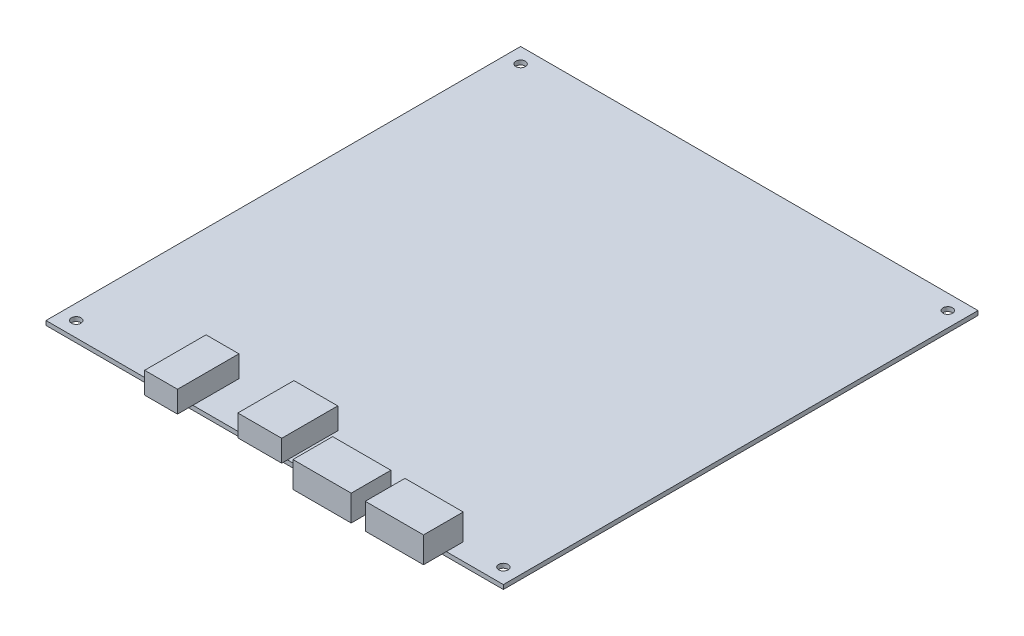
ISO-10303-21;
HEADER;
FILE_DESCRIPTION(('STEP AP214'),'2;1');
FILE_NAME('part.step','',(''),(''),'','','');
FILE_SCHEMA(('AUTOMOTIVE_DESIGN { 1 0 10303 214 1 1 1 1 }'));
ENDSEC;
DATA;
#1=APPLICATION_CONTEXT('core data for automotive mechanical design processes');
#2=APPLICATION_PROTOCOL_DEFINITION('international standard','automotive_design',2000,#1);
#3=PRODUCT_CONTEXT('',#1,'mechanical');
#4=PRODUCT('Part','Part','',(#3));
#5=PRODUCT_RELATED_PRODUCT_CATEGORY('part','',(#4));
#6=PRODUCT_DEFINITION_FORMATION('','',#4);
#7=PRODUCT_DEFINITION_CONTEXT('part definition',#1,'design');
#8=PRODUCT_DEFINITION('design','',#6,#7);
#9=PRODUCT_DEFINITION_SHAPE('','',#8);
#10=(LENGTH_UNIT() NAMED_UNIT(*) SI_UNIT(.MILLI.,.METRE.));
#11=(NAMED_UNIT(*) PLANE_ANGLE_UNIT() SI_UNIT($,.RADIAN.));
#12=(NAMED_UNIT(*) SI_UNIT($,.STERADIAN.) SOLID_ANGLE_UNIT());
#13=UNCERTAINTY_MEASURE_WITH_UNIT(LENGTH_MEASURE(1.E-05),#10,'distance_accuracy_value','');
#14=(GEOMETRIC_REPRESENTATION_CONTEXT(3) GLOBAL_UNCERTAINTY_ASSIGNED_CONTEXT((#13)) GLOBAL_UNIT_ASSIGNED_CONTEXT((#10,
#11,#12)) REPRESENTATION_CONTEXT('',''));
#15=CARTESIAN_POINT('',(0.,0.,0.));
#16=DIRECTION('',(0.,0.,1.));
#17=DIRECTION('',(1.,0.,0.));
#18=AXIS2_PLACEMENT_3D('',#15,#16,#17);
#19=CARTESIAN_POINT('',(-44.0442723681258,1.,10.0561799951606));
#20=DIRECTION('',(0.,1.,0.));
#21=DIRECTION('',(0.,0.,1.));
#22=AXIS2_PLACEMENT_3D('',#19,#20,#21);
#23=PLANE('',#22);
#24=CARTESIAN_POINT('',(58.4557276318742,1.,-96.4438200048394));
#25=DIRECTION('',(0.,1.,0.));
#26=DIRECTION('',(0.,0.,1.));
#27=AXIS2_PLACEMENT_3D('',#24,#25,#26);
#28=CIRCLE('',#27,1.10000000000001);
#29=CARTESIAN_POINT('',(58.4557276318742,1.,-95.3438200048394));
#30=VERTEX_POINT('',#29);
#31=EDGE_CURVE('E324',#30,#30,#28,.T.);
#32=ORIENTED_EDGE('',*,*,#31,.F.);
#33=EDGE_LOOP('',(#32));
#34=FACE_BOUND('',#33,.T.);
#35=CARTESIAN_POINT('',(58.4557276318742,1.,6.55617999516062));
#36=DIRECTION('',(0.,1.,0.));
#37=DIRECTION('',(0.,0.,1.));
#38=AXIS2_PLACEMENT_3D('',#35,#36,#37);
#39=CIRCLE('',#38,1.10000000000001);
#40=CARTESIAN_POINT('',(58.4557276318742,1.,7.65617999516062));
#41=VERTEX_POINT('',#40);
#42=EDGE_CURVE('E336',#41,#41,#39,.T.);
#43=ORIENTED_EDGE('',*,*,#42,.F.);
#44=EDGE_LOOP('',(#43));
#45=FACE_BOUND('',#44,.T.);
#46=CARTESIAN_POINT('',(-40.5442723681258,1.,6.55617999516062));
#47=DIRECTION('',(0.,1.,0.));
#48=DIRECTION('',(0.,0.,1.));
#49=AXIS2_PLACEMENT_3D('',#46,#47,#48);
#50=CIRCLE('',#49,1.10000000000001);
#51=CARTESIAN_POINT('',(-40.5442723681258,1.,7.65617999516063));
#52=VERTEX_POINT('',#51);
#53=EDGE_CURVE('E342',#52,#52,#50,.T.);
#54=ORIENTED_EDGE('',*,*,#53,.F.);
#55=EDGE_LOOP('',(#54));
#56=FACE_BOUND('',#55,.T.);
#57=CARTESIAN_POINT('',(-40.5442723681258,1.,-96.4438200048394));
#58=DIRECTION('',(0.,1.,0.));
#59=DIRECTION('',(0.,0.,1.));
#60=AXIS2_PLACEMENT_3D('',#57,#58,#59);
#61=CIRCLE('',#60,1.10000000000001);
#62=CARTESIAN_POINT('',(-40.5442723681258,1.,-95.3438200048394));
#63=VERTEX_POINT('',#62);
#64=EDGE_CURVE('E330',#63,#63,#61,.T.);
#65=ORIENTED_EDGE('',*,*,#64,.F.);
#66=EDGE_LOOP('',(#65));
#67=FACE_BOUND('',#66,.T.);
#68=DIRECTION('',(1.,0.,0.));
#69=VECTOR('',#68,1.);
#70=CARTESIAN_POINT('',(-44.0442723681258,1.,10.0561799951606));
#71=LINE('',#70,#69);
#72=CARTESIAN_POINT('',(31.9757276318742,1.,10.0561799951606));
#73=VERTEX_POINT('',#72);
#74=CARTESIAN_POINT('',(35.2357276318742,1.,10.0561799951606));
#75=VERTEX_POINT('',#74);
#76=EDGE_CURVE('E400',#73,#75,#71,.T.);
#77=ORIENTED_EDGE('',*,*,#76,.T.);
#78=DIRECTION('',(0.,0.,1.));
#79=VECTOR('',#78,1.);
#80=CARTESIAN_POINT('',(35.2357276318742,1.,6.14617999516061));
#81=LINE('',#80,#79);
#82=CARTESIAN_POINT('',(35.2357276318742,1.,6.14617999516061));
#83=VERTEX_POINT('',#82);
#84=EDGE_CURVE('E57',#83,#75,#81,.T.);
#85=ORIENTED_EDGE('',*,*,#84,.F.);
#86=DIRECTION('',(-1.,0.,0.));
#87=VECTOR('',#86,1.);
#88=CARTESIAN_POINT('',(35.2357276318742,1.,6.14617999516061));
#89=LINE('',#88,#87);
#90=CARTESIAN_POINT('',(48.7357276318742,1.,6.14617999516061));
#91=VERTEX_POINT('',#90);
#92=EDGE_CURVE('E52',#91,#83,#89,.T.);
#93=ORIENTED_EDGE('',*,*,#92,.F.);
#94=DIRECTION('',(0.,0.,-1.));
#95=VECTOR('',#94,1.);
#96=CARTESIAN_POINT('',(48.7357276318742,1.,6.14617999516061));
#97=LINE('',#96,#95);
#98=CARTESIAN_POINT('',(48.7357276318742,1.,10.0561799951606));
#99=VERTEX_POINT('',#98);
#100=EDGE_CURVE('E397',#99,#91,#97,.T.);
#101=ORIENTED_EDGE('',*,*,#100,.F.);
#102=CARTESIAN_POINT('',(61.9557276318742,1.,10.0561799951606));
#103=VERTEX_POINT('',#102);
#104=EDGE_CURVE('E351',#99,#103,#71,.T.);
#105=ORIENTED_EDGE('',*,*,#104,.T.);
#106=DIRECTION('',(0.,0.,-1.));
#107=VECTOR('',#106,1.);
#108=CARTESIAN_POINT('',(61.9557276318742,1.,-99.9438200048394));
#109=LINE('',#108,#107);
#110=CARTESIAN_POINT('',(61.9557276318742,1.,-99.9438200048394));
#111=VERTEX_POINT('',#110);
#112=EDGE_CURVE('E355',#103,#111,#109,.T.);
#113=ORIENTED_EDGE('',*,*,#112,.T.);
#114=DIRECTION('',(-1.,0.,0.));
#115=VECTOR('',#114,1.);
#116=CARTESIAN_POINT('',(-44.0442723681258,1.,-99.9438200048394));
#117=LINE('',#116,#115);
#118=CARTESIAN_POINT('',(-44.0442723681258,1.,-99.9438200048394));
#119=VERTEX_POINT('',#118);
#120=EDGE_CURVE('E358',#111,#119,#117,.T.);
#121=ORIENTED_EDGE('',*,*,#120,.T.);
#122=DIRECTION('',(0.,0.,1.));
#123=VECTOR('',#122,1.);
#124=CARTESIAN_POINT('',(-44.0442723681258,1.,-99.9438200048394));
#125=LINE('',#124,#123);
#126=CARTESIAN_POINT('',(-44.0442723681258,1.,10.0561799951606));
#127=VERTEX_POINT('',#126);
#128=EDGE_CURVE('E348',#119,#127,#125,.T.);
#129=ORIENTED_EDGE('',*,*,#128,.T.);
#130=CARTESIAN_POINT('',(-17.6242723681258,1.,10.0561799951606));
#131=VERTEX_POINT('',#130);
#132=EDGE_CURVE('E353',#127,#131,#71,.T.);
#133=ORIENTED_EDGE('',*,*,#132,.T.);
#134=DIRECTION('',(0.,0.,1.));
#135=VECTOR('',#134,1.);
#136=CARTESIAN_POINT('',(-17.6242723681258,1.,-0.613820004839382));
#137=LINE('',#136,#135);
#138=CARTESIAN_POINT('',(-17.6242723681258,1.,-0.613820004839382));
#139=VERTEX_POINT('',#138);
#140=EDGE_CURVE('E308',#139,#131,#137,.T.);
#141=ORIENTED_EDGE('',*,*,#140,.F.);
#142=DIRECTION('',(-1.,0.,0.));
#143=VECTOR('',#142,1.);
#144=CARTESIAN_POINT('',(-17.6242723681258,1.,-0.613820004839382));
#145=LINE('',#144,#143);
#146=CARTESIAN_POINT('',(-10.0042723681258,1.,-0.613820004839382));
#147=VERTEX_POINT('',#146);
#148=EDGE_CURVE('E300',#147,#139,#145,.T.);
#149=ORIENTED_EDGE('',*,*,#148,.F.);
#150=DIRECTION('',(0.,0.,-1.));
#151=VECTOR('',#150,1.);
#152=CARTESIAN_POINT('',(-10.0042723681258,1.,-0.613820004839382));
#153=LINE('',#152,#151);
#154=CARTESIAN_POINT('',(-10.0042723681258,1.,10.0561799951606));
#155=VERTEX_POINT('',#154);
#156=EDGE_CURVE('E12',#155,#147,#153,.T.);
#157=ORIENTED_EDGE('',*,*,#156,.F.);
#158=CARTESIAN_POINT('',(1.74572763187419,1.,10.0561799951606));
#159=VERTEX_POINT('',#158);
#160=EDGE_CURVE('E415',#155,#159,#71,.T.);
#161=ORIENTED_EDGE('',*,*,#160,.T.);
#162=DIRECTION('',(0.,0.,1.));
#163=VECTOR('',#162,1.);
#164=CARTESIAN_POINT('',(1.74572763187418,1.,-1.61382000483938));
#165=LINE('',#164,#163);
#166=CARTESIAN_POINT('',(1.74572763187419,1.,-1.61382000483938));
#167=VERTEX_POINT('',#166);
#168=EDGE_CURVE('E273',#167,#159,#165,.T.);
#169=ORIENTED_EDGE('',*,*,#168,.F.);
#170=DIRECTION('',(-1.,0.,0.));
#171=VECTOR('',#170,1.);
#172=CARTESIAN_POINT('',(1.74572763187418,1.,-1.61382000483938));
#173=LINE('',#172,#171);
#174=CARTESIAN_POINT('',(11.9057276318742,1.,-1.61382000483938));
#175=VERTEX_POINT('',#174);
#176=EDGE_CURVE('E266',#175,#167,#173,.T.);
#177=ORIENTED_EDGE('',*,*,#176,.F.);
#178=DIRECTION('',(0.,0.,-1.));
#179=VECTOR('',#178,1.);
#180=CARTESIAN_POINT('',(11.9057276318742,1.,-1.61382000483938));
#181=LINE('',#180,#179);
#182=CARTESIAN_POINT('',(11.9057276318742,1.,10.0561799951606));
#183=VERTEX_POINT('',#182);
#184=EDGE_CURVE('E278',#183,#175,#181,.T.);
#185=ORIENTED_EDGE('',*,*,#184,.F.);
#186=CARTESIAN_POINT('',(18.4757276318742,1.,10.0561799951606));
#187=VERTEX_POINT('',#186);
#188=EDGE_CURVE('E407',#183,#187,#71,.T.);
#189=ORIENTED_EDGE('',*,*,#188,.T.);
#190=DIRECTION('',(0.,0.,1.));
#191=VECTOR('',#190,1.);
#192=CARTESIAN_POINT('',(18.4757276318742,1.,6.14617999516062));
#193=LINE('',#192,#191);
#194=CARTESIAN_POINT('',(18.4757276318742,1.,6.14617999516062));
#195=VERTEX_POINT('',#194);
#196=EDGE_CURVE('E224',#195,#187,#193,.T.);
#197=ORIENTED_EDGE('',*,*,#196,.F.);
#198=DIRECTION('',(-1.,0.,0.));
#199=VECTOR('',#198,1.);
#200=CARTESIAN_POINT('',(18.4757276318742,1.,6.14617999516062));
#201=LINE('',#200,#199);
#202=CARTESIAN_POINT('',(31.9757276318742,1.,6.14617999516061));
#203=VERTEX_POINT('',#202);
#204=EDGE_CURVE('E234',#203,#195,#201,.T.);
#205=ORIENTED_EDGE('',*,*,#204,.F.);
#206=DIRECTION('',(0.,0.,-1.));
#207=VECTOR('',#206,1.);
#208=CARTESIAN_POINT('',(31.9757276318742,1.,6.14617999516061));
#209=LINE('',#208,#207);
#210=EDGE_CURVE('E244',#73,#203,#209,.T.);
#211=ORIENTED_EDGE('',*,*,#210,.F.);
#212=EDGE_LOOP('',(#77,#85,#93,#101,#105,#113,#121,#129,#133,#141,#149,#157,#161,#169,#177,#185,
#189,#197,#205,#211));
#213=FACE_BOUND('',#212,.T.);
#214=ADVANCED_FACE('F36',(#34,#45,#56,#67,#213),#23,.T.);
#215=CARTESIAN_POINT('',(-44.0442723681258,0.,10.0561799951606));
#216=DIRECTION('',(0.,1.,0.));
#217=DIRECTION('',(0.,0.,1.));
#218=AXIS2_PLACEMENT_3D('',#215,#216,#217);
#219=PLANE('',#218);
#220=CARTESIAN_POINT('',(-40.5442723681258,0.,-96.4438200048394));
#221=DIRECTION('',(0.,1.,0.));
#222=DIRECTION('',(0.,0.,1.));
#223=AXIS2_PLACEMENT_3D('',#220,#221,#222);
#224=CIRCLE('',#223,1.10000000000001);
#225=CARTESIAN_POINT('',(-40.5442723681258,0.,-95.3438200048394));
#226=VERTEX_POINT('',#225);
#227=EDGE_CURVE('E327',#226,#226,#224,.T.);
#228=ORIENTED_EDGE('',*,*,#227,.T.);
#229=EDGE_LOOP('',(#228));
#230=FACE_BOUND('',#229,.T.);
#231=CARTESIAN_POINT('',(-40.5442723681258,0.,6.55617999516062));
#232=DIRECTION('',(0.,1.,0.));
#233=DIRECTION('',(0.,0.,1.));
#234=AXIS2_PLACEMENT_3D('',#231,#232,#233);
#235=CIRCLE('',#234,1.10000000000001);
#236=CARTESIAN_POINT('',(-40.5442723681258,0.,7.65617999516063));
#237=VERTEX_POINT('',#236);
#238=EDGE_CURVE('E339',#237,#237,#235,.T.);
#239=ORIENTED_EDGE('',*,*,#238,.T.);
#240=EDGE_LOOP('',(#239));
#241=FACE_BOUND('',#240,.T.);
#242=DIRECTION('',(0.,0.,1.));
#243=VECTOR('',#242,1.);
#244=CARTESIAN_POINT('',(-44.0442723681258,0.,-99.9438200048394));
#245=LINE('',#244,#243);
#246=CARTESIAN_POINT('',(-44.0442723681258,0.,-99.9438200048394));
#247=VERTEX_POINT('',#246);
#248=CARTESIAN_POINT('',(-44.0442723681258,0.,10.0561799951606));
#249=VERTEX_POINT('',#248);
#250=EDGE_CURVE('E345',#247,#249,#245,.T.);
#251=ORIENTED_EDGE('',*,*,#250,.F.);
#252=DIRECTION('',(-1.,0.,0.));
#253=VECTOR('',#252,1.);
#254=CARTESIAN_POINT('',(-44.0442723681258,0.,-99.9438200048394));
#255=LINE('',#254,#253);
#256=CARTESIAN_POINT('',(61.9557276318742,0.,-99.9438200048394));
#257=VERTEX_POINT('',#256);
#258=EDGE_CURVE('E352',#257,#247,#255,.T.);
#259=ORIENTED_EDGE('',*,*,#258,.F.);
#260=DIRECTION('',(0.,0.,-1.));
#261=VECTOR('',#260,1.);
#262=CARTESIAN_POINT('',(61.9557276318742,0.,-99.9438200048394));
#263=LINE('',#262,#261);
#264=CARTESIAN_POINT('',(61.9557276318742,0.,10.0561799951606));
#265=VERTEX_POINT('',#264);
#266=EDGE_CURVE('E365',#265,#257,#263,.T.);
#267=ORIENTED_EDGE('',*,*,#266,.F.);
#268=DIRECTION('',(1.,0.,0.));
#269=VECTOR('',#268,1.);
#270=CARTESIAN_POINT('',(-44.0442723681258,0.,10.0561799951606));
#271=LINE('',#270,#269);
#272=EDGE_CURVE('E363',#249,#265,#271,.T.);
#273=ORIENTED_EDGE('',*,*,#272,.F.);
#274=EDGE_LOOP('',(#251,#259,#267,#273));
#275=FACE_BOUND('',#274,.T.);
#276=CARTESIAN_POINT('',(58.4557276318742,0.,6.55617999516062));
#277=DIRECTION('',(0.,1.,0.));
#278=DIRECTION('',(0.,0.,1.));
#279=AXIS2_PLACEMENT_3D('',#276,#277,#278);
#280=CIRCLE('',#279,1.10000000000001);
#281=CARTESIAN_POINT('',(58.4557276318742,0.,7.65617999516062));
#282=VERTEX_POINT('',#281);
#283=EDGE_CURVE('E333',#282,#282,#280,.T.);
#284=ORIENTED_EDGE('',*,*,#283,.T.);
#285=EDGE_LOOP('',(#284));
#286=FACE_BOUND('',#285,.T.);
#287=CARTESIAN_POINT('',(58.4557276318742,0.,-96.4438200048394));
#288=DIRECTION('',(0.,1.,0.));
#289=DIRECTION('',(0.,0.,1.));
#290=AXIS2_PLACEMENT_3D('',#287,#288,#289);
#291=CIRCLE('',#290,1.10000000000001);
#292=CARTESIAN_POINT('',(58.4557276318742,0.,-95.3438200048394));
#293=VERTEX_POINT('',#292);
#294=EDGE_CURVE('E311',#293,#293,#291,.T.);
#295=ORIENTED_EDGE('',*,*,#294,.T.);
#296=EDGE_LOOP('',(#295));
#297=FACE_BOUND('',#296,.T.);
#298=ADVANCED_FACE('F387',(#230,#241,#275,#286,#297),#219,.F.);
#299=CARTESIAN_POINT('',(-44.0442723681258,1.,-99.9438200048394));
#300=DIRECTION('',(1.,0.,0.));
#301=DIRECTION('',(0.,0.,-1.));
#302=AXIS2_PLACEMENT_3D('',#299,#300,#301);
#303=PLANE('',#302);
#304=ORIENTED_EDGE('',*,*,#250,.T.);
#305=DIRECTION('',(0.,-1.,0.));
#306=VECTOR('',#305,1.);
#307=CARTESIAN_POINT('',(-44.0442723681258,1.,10.0561799951606));
#308=LINE('',#307,#306);
#309=EDGE_CURVE('E45',#127,#249,#308,.T.);
#310=ORIENTED_EDGE('',*,*,#309,.F.);
#311=ORIENTED_EDGE('',*,*,#128,.F.);
#312=DIRECTION('',(0.,-1.,0.));
#313=VECTOR('',#312,1.);
#314=CARTESIAN_POINT('',(-44.0442723681258,1.,-99.9438200048394));
#315=LINE('',#314,#313);
#316=EDGE_CURVE('E360',#119,#247,#315,.T.);
#317=ORIENTED_EDGE('',*,*,#316,.T.);
#318=EDGE_LOOP('',(#304,#310,#311,#317));
#319=FACE_BOUND('',#318,.T.);
#320=ADVANCED_FACE('F38',(#319),#303,.F.);
#321=CARTESIAN_POINT('',(-44.0442723681258,1.,10.0561799951606));
#322=DIRECTION('',(0.,0.,-1.));
#323=DIRECTION('',(-1.,0.,0.));
#324=AXIS2_PLACEMENT_3D('',#321,#322,#323);
#325=PLANE('',#324);
#326=ORIENTED_EDGE('',*,*,#272,.T.);
#327=DIRECTION('',(0.,-1.,0.));
#328=VECTOR('',#327,1.);
#329=CARTESIAN_POINT('',(61.9557276318742,1.,10.0561799951606));
#330=LINE('',#329,#328);
#331=EDGE_CURVE('E373',#103,#265,#330,.T.);
#332=ORIENTED_EDGE('',*,*,#331,.F.);
#333=ORIENTED_EDGE('',*,*,#104,.F.);
#334=EDGE_CURVE('E399',#75,#99,#71,.T.);
#335=ORIENTED_EDGE('',*,*,#334,.F.);
#336=ORIENTED_EDGE('',*,*,#76,.F.);
#337=EDGE_CURVE('E404',#187,#73,#71,.T.);
#338=ORIENTED_EDGE('',*,*,#337,.F.);
#339=ORIENTED_EDGE('',*,*,#188,.F.);
#340=EDGE_CURVE('E412',#159,#183,#71,.T.);
#341=ORIENTED_EDGE('',*,*,#340,.F.);
#342=ORIENTED_EDGE('',*,*,#160,.F.);
#343=EDGE_CURVE('E356',#131,#155,#71,.T.);
#344=ORIENTED_EDGE('',*,*,#343,.F.);
#345=ORIENTED_EDGE('',*,*,#132,.F.);
#346=ORIENTED_EDGE('',*,*,#309,.T.);
#347=EDGE_LOOP('',(#326,#332,#333,#335,#336,#338,#339,#341,#342,#344,#345,#346));
#348=FACE_BOUND('',#347,.T.);
#349=ADVANCED_FACE('F378',(#348),#325,.F.);
#350=CARTESIAN_POINT('',(61.9557276318742,1.,-99.9438200048394));
#351=DIRECTION('',(-1.,0.,0.));
#352=DIRECTION('',(0.,0.,1.));
#353=AXIS2_PLACEMENT_3D('',#350,#351,#352);
#354=PLANE('',#353);
#355=ORIENTED_EDGE('',*,*,#266,.T.);
#356=DIRECTION('',(0.,-1.,0.));
#357=VECTOR('',#356,1.);
#358=CARTESIAN_POINT('',(61.9557276318742,1.,-99.9438200048394));
#359=LINE('',#358,#357);
#360=EDGE_CURVE('E370',#111,#257,#359,.T.);
#361=ORIENTED_EDGE('',*,*,#360,.F.);
#362=ORIENTED_EDGE('',*,*,#112,.F.);
#363=ORIENTED_EDGE('',*,*,#331,.T.);
#364=EDGE_LOOP('',(#355,#361,#362,#363));
#365=FACE_BOUND('',#364,.T.);
#366=ADVANCED_FACE('F392',(#365),#354,.F.);
#367=CARTESIAN_POINT('',(-44.0442723681258,1.,-99.9438200048394));
#368=DIRECTION('',(0.,0.,1.));
#369=DIRECTION('',(1.,0.,0.));
#370=AXIS2_PLACEMENT_3D('',#367,#368,#369);
#371=PLANE('',#370);
#372=ORIENTED_EDGE('',*,*,#258,.T.);
#373=ORIENTED_EDGE('',*,*,#316,.F.);
#374=ORIENTED_EDGE('',*,*,#120,.F.);
#375=ORIENTED_EDGE('',*,*,#360,.T.);
#376=EDGE_LOOP('',(#372,#373,#374,#375));
#377=FACE_BOUND('',#376,.T.);
#378=ADVANCED_FACE('F396',(#377),#371,.F.);
#379=CARTESIAN_POINT('',(-40.5442723681258,1.,6.55617999516062));
#380=DIRECTION('',(0.,-1.,0.));
#381=DIRECTION('',(0.,0.,-1.));
#382=AXIS2_PLACEMENT_3D('',#379,#380,#381);
#383=CYLINDRICAL_SURFACE('',#382,1.10000000000001);
#384=ORIENTED_EDGE('',*,*,#53,.T.);
#385=EDGE_LOOP('',(#384));
#386=FACE_BOUND('',#385,.T.);
#387=ORIENTED_EDGE('',*,*,#238,.F.);
#388=EDGE_LOOP('',(#387));
#389=FACE_BOUND('',#388,.T.);
#390=ADVANCED_FACE('F500',(#386,#389),#383,.F.);
#391=CARTESIAN_POINT('',(58.4557276318742,1.,6.55617999516062));
#392=DIRECTION('',(0.,-1.,0.));
#393=DIRECTION('',(0.,0.,-1.));
#394=AXIS2_PLACEMENT_3D('',#391,#392,#393);
#395=CYLINDRICAL_SURFACE('',#394,1.10000000000001);
#396=ORIENTED_EDGE('',*,*,#42,.T.);
#397=EDGE_LOOP('',(#396));
#398=FACE_BOUND('',#397,.T.);
#399=ORIENTED_EDGE('',*,*,#283,.F.);
#400=EDGE_LOOP('',(#399));
#401=FACE_BOUND('',#400,.T.);
#402=ADVANCED_FACE('F543',(#398,#401),#395,.F.);
#403=CARTESIAN_POINT('',(-40.5442723681258,1.,-96.4438200048394));
#404=DIRECTION('',(0.,-1.,0.));
#405=DIRECTION('',(0.,0.,-1.));
#406=AXIS2_PLACEMENT_3D('',#403,#404,#405);
#407=CYLINDRICAL_SURFACE('',#406,1.10000000000001);
#408=ORIENTED_EDGE('',*,*,#64,.T.);
#409=EDGE_LOOP('',(#408));
#410=FACE_BOUND('',#409,.T.);
#411=ORIENTED_EDGE('',*,*,#227,.F.);
#412=EDGE_LOOP('',(#411));
#413=FACE_BOUND('',#412,.T.);
#414=ADVANCED_FACE('F551',(#410,#413),#407,.F.);
#415=CARTESIAN_POINT('',(58.4557276318742,1.,-96.4438200048394));
#416=DIRECTION('',(0.,-1.,0.));
#417=DIRECTION('',(0.,0.,-1.));
#418=AXIS2_PLACEMENT_3D('',#415,#416,#417);
#419=CYLINDRICAL_SURFACE('',#418,1.10000000000001);
#420=ORIENTED_EDGE('',*,*,#31,.T.);
#421=EDGE_LOOP('',(#420));
#422=FACE_BOUND('',#421,.T.);
#423=ORIENTED_EDGE('',*,*,#294,.F.);
#424=EDGE_LOOP('',(#423));
#425=FACE_BOUND('',#424,.T.);
#426=ADVANCED_FACE('F483',(#422,#425),#419,.F.);
#427=CARTESIAN_POINT('',(-39.5117966688814,1.,6.50117999516062));
#428=DIRECTION('',(0.,1.,0.));
#429=DIRECTION('',(0.,0.,1.));
#430=AXIS2_PLACEMENT_3D('',#427,#428,#429);
#431=PLANE('',#430);
#432=CARTESIAN_POINT('',(-17.6242723681258,1.,13.6161799951606));
#433=VERTEX_POINT('',#432);
#434=EDGE_CURVE('E312',#131,#433,#137,.T.);
#435=ORIENTED_EDGE('',*,*,#434,.F.);
#436=ORIENTED_EDGE('',*,*,#343,.T.);
#437=CARTESIAN_POINT('',(-10.0042723681258,1.,13.6161799951606));
#438=VERTEX_POINT('',#437);
#439=EDGE_CURVE('E427',#438,#155,#153,.T.);
#440=ORIENTED_EDGE('',*,*,#439,.F.);
#441=DIRECTION('',(1.,0.,0.));
#442=VECTOR('',#441,1.);
#443=CARTESIAN_POINT('',(-17.6242723681258,1.,13.6161799951606));
#444=LINE('',#443,#442);
#445=EDGE_CURVE('E458',#433,#438,#444,.T.);
#446=ORIENTED_EDGE('',*,*,#445,.F.);
#447=EDGE_LOOP('',(#435,#436,#440,#446));
#448=FACE_BOUND('',#447,.T.);
#449=ADVANCED_FACE('F425',(#448),#431,.F.);
#450=CARTESIAN_POINT('',(-39.5117966688814,6.,6.50117999516062));
#451=DIRECTION('',(0.,1.,0.));
#452=DIRECTION('',(0.,0.,1.));
#453=AXIS2_PLACEMENT_3D('',#450,#451,#452);
#454=PLANE('',#453);
#455=DIRECTION('',(-1.,0.,0.));
#456=VECTOR('',#455,1.);
#457=CARTESIAN_POINT('',(-17.6242723681258,6.,-0.613820004839382));
#458=LINE('',#457,#456);
#459=CARTESIAN_POINT('',(-10.0042723681258,6.,-0.613820004839382));
#460=VERTEX_POINT('',#459);
#461=CARTESIAN_POINT('',(-17.6242723681258,6.,-0.613820004839382));
#462=VERTEX_POINT('',#461);
#463=EDGE_CURVE('E295',#460,#462,#458,.T.);
#464=ORIENTED_EDGE('',*,*,#463,.T.);
#465=DIRECTION('',(0.,0.,1.));
#466=VECTOR('',#465,1.);
#467=CARTESIAN_POINT('',(-17.6242723681258,6.,-0.613820004839382));
#468=LINE('',#467,#466);
#469=CARTESIAN_POINT('',(-17.6242723681258,6.,13.6161799951606));
#470=VERTEX_POINT('',#469);
#471=EDGE_CURVE('E321',#462,#470,#468,.T.);
#472=ORIENTED_EDGE('',*,*,#471,.T.);
#473=DIRECTION('',(1.,0.,0.));
#474=VECTOR('',#473,1.);
#475=CARTESIAN_POINT('',(-17.6242723681258,6.,13.6161799951606));
#476=LINE('',#475,#474);
#477=CARTESIAN_POINT('',(-10.0042723681258,6.,13.6161799951606));
#478=VERTEX_POINT('',#477);
#479=EDGE_CURVE('E437',#470,#478,#476,.T.);
#480=ORIENTED_EDGE('',*,*,#479,.T.);
#481=DIRECTION('',(0.,0.,-1.));
#482=VECTOR('',#481,1.);
#483=CARTESIAN_POINT('',(-10.0042723681258,6.,-0.613820004839382));
#484=LINE('',#483,#482);
#485=EDGE_CURVE('E299',#478,#460,#484,.T.);
#486=ORIENTED_EDGE('',*,*,#485,.T.);
#487=EDGE_LOOP('',(#464,#472,#480,#486));
#488=FACE_BOUND('',#487,.T.);
#489=ADVANCED_FACE('F472',(#488),#454,.T.);
#490=CARTESIAN_POINT('',(-17.6242723681258,1.,-0.613820004839382));
#491=DIRECTION('',(0.,0.,-1.));
#492=DIRECTION('',(-1.,0.,0.));
#493=AXIS2_PLACEMENT_3D('',#490,#491,#492);
#494=PLANE('',#493);
#495=ORIENTED_EDGE('',*,*,#463,.F.);
#496=DIRECTION('',(0.,1.,0.));
#497=VECTOR('',#496,1.);
#498=CARTESIAN_POINT('',(-10.0042723681258,1.,-0.613820004839382));
#499=LINE('',#498,#497);
#500=EDGE_CURVE('E305',#147,#460,#499,.T.);
#501=ORIENTED_EDGE('',*,*,#500,.F.);
#502=ORIENTED_EDGE('',*,*,#148,.T.);
#503=DIRECTION('',(0.,1.,0.));
#504=VECTOR('',#503,1.);
#505=CARTESIAN_POINT('',(-17.6242723681258,1.,-0.613820004839382));
#506=LINE('',#505,#504);
#507=EDGE_CURVE('E296',#139,#462,#506,.T.);
#508=ORIENTED_EDGE('',*,*,#507,.T.);
#509=EDGE_LOOP('',(#495,#501,#502,#508));
#510=FACE_BOUND('',#509,.T.);
#511=ADVANCED_FACE('F474',(#510),#494,.T.);
#512=CARTESIAN_POINT('',(-10.0042723681258,1.,-0.613820004839382));
#513=DIRECTION('',(1.,0.,0.));
#514=DIRECTION('',(0.,0.,-1.));
#515=AXIS2_PLACEMENT_3D('',#512,#513,#514);
#516=PLANE('',#515);
#517=ORIENTED_EDGE('',*,*,#485,.F.);
#518=DIRECTION('',(0.,1.,0.));
#519=VECTOR('',#518,1.);
#520=CARTESIAN_POINT('',(-10.0042723681258,1.,13.6161799951606));
#521=LINE('',#520,#519);
#522=EDGE_CURVE('E435',#438,#478,#521,.T.);
#523=ORIENTED_EDGE('',*,*,#522,.F.);
#524=ORIENTED_EDGE('',*,*,#439,.T.);
#525=ORIENTED_EDGE('',*,*,#156,.T.);
#526=ORIENTED_EDGE('',*,*,#500,.T.);
#527=EDGE_LOOP('',(#517,#523,#524,#525,#526));
#528=FACE_BOUND('',#527,.T.);
#529=ADVANCED_FACE('F431',(#528),#516,.T.);
#530=CARTESIAN_POINT('',(-17.6242723681258,1.,13.6161799951606));
#531=DIRECTION('',(0.,0.,1.));
#532=DIRECTION('',(1.,0.,0.));
#533=AXIS2_PLACEMENT_3D('',#530,#531,#532);
#534=PLANE('',#533);
#535=ORIENTED_EDGE('',*,*,#479,.F.);
#536=DIRECTION('',(0.,1.,0.));
#537=VECTOR('',#536,1.);
#538=CARTESIAN_POINT('',(-17.6242723681258,1.,13.6161799951606));
#539=LINE('',#538,#537);
#540=EDGE_CURVE('E315',#433,#470,#539,.T.);
#541=ORIENTED_EDGE('',*,*,#540,.F.);
#542=ORIENTED_EDGE('',*,*,#445,.T.);
#543=ORIENTED_EDGE('',*,*,#522,.T.);
#544=EDGE_LOOP('',(#535,#541,#542,#543));
#545=FACE_BOUND('',#544,.T.);
#546=ADVANCED_FACE('F471',(#545),#534,.T.);
#547=CARTESIAN_POINT('',(-17.6242723681258,1.,-0.613820004839382));
#548=DIRECTION('',(-1.,0.,0.));
#549=DIRECTION('',(0.,0.,1.));
#550=AXIS2_PLACEMENT_3D('',#547,#548,#549);
#551=PLANE('',#550);
#552=ORIENTED_EDGE('',*,*,#471,.F.);
#553=ORIENTED_EDGE('',*,*,#507,.F.);
#554=ORIENTED_EDGE('',*,*,#140,.T.);
#555=ORIENTED_EDGE('',*,*,#434,.T.);
#556=ORIENTED_EDGE('',*,*,#540,.T.);
#557=EDGE_LOOP('',(#552,#553,#554,#555,#556));
#558=FACE_BOUND('',#557,.T.);
#559=ADVANCED_FACE('F469',(#558),#551,.T.);
#560=CARTESIAN_POINT('',(1.74572763187419,1.,11.3861799951606));
#561=DIRECTION('',(0.,1.,0.));
#562=DIRECTION('',(0.,0.,1.));
#563=AXIS2_PLACEMENT_3D('',#560,#561,#562);
#564=PLANE('',#563);
#565=CARTESIAN_POINT('',(1.74572763187419,1.,11.3861799951606));
#566=VERTEX_POINT('',#565);
#567=EDGE_CURVE('E261',#159,#566,#165,.T.);
#568=ORIENTED_EDGE('',*,*,#567,.F.);
#569=ORIENTED_EDGE('',*,*,#340,.T.);
#570=CARTESIAN_POINT('',(11.9057276318742,1.,11.3861799951606));
#571=VERTEX_POINT('',#570);
#572=EDGE_CURVE('E279',#571,#183,#181,.T.);
#573=ORIENTED_EDGE('',*,*,#572,.F.);
#574=DIRECTION('',(1.,0.,0.));
#575=VECTOR('',#574,1.);
#576=CARTESIAN_POINT('',(1.74572763187419,1.,11.3861799951606));
#577=LINE('',#576,#575);
#578=EDGE_CURVE('E276',#566,#571,#577,.T.);
#579=ORIENTED_EDGE('',*,*,#578,.F.);
#580=EDGE_LOOP('',(#568,#569,#573,#579));
#581=FACE_BOUND('',#580,.T.);
#582=ADVANCED_FACE('F476',(#581),#564,.F.);
#583=CARTESIAN_POINT('',(1.74572763187418,6.,-1.61382000483938));
#584=DIRECTION('',(1.,0.,0.));
#585=DIRECTION('',(0.,0.,-1.));
#586=AXIS2_PLACEMENT_3D('',#583,#584,#585);
#587=PLANE('',#586);
#588=ORIENTED_EDGE('',*,*,#168,.T.);
#589=ORIENTED_EDGE('',*,*,#567,.T.);
#590=DIRECTION('',(0.,-1.,0.));
#591=VECTOR('',#590,1.);
#592=CARTESIAN_POINT('',(1.74572763187419,6.,11.3861799951606));
#593=LINE('',#592,#591);
#594=CARTESIAN_POINT('',(1.74572763187419,6.,11.3861799951606));
#595=VERTEX_POINT('',#594);
#596=EDGE_CURVE('E292',#595,#566,#593,.T.);
#597=ORIENTED_EDGE('',*,*,#596,.F.);
#598=DIRECTION('',(0.,0.,1.));
#599=VECTOR('',#598,1.);
#600=CARTESIAN_POINT('',(1.74572763187418,6.,-1.61382000483938));
#601=LINE('',#600,#599);
#602=CARTESIAN_POINT('',(1.74572763187418,6.,-1.61382000483938));
#603=VERTEX_POINT('',#602);
#604=EDGE_CURVE('E262',#603,#595,#601,.T.);
#605=ORIENTED_EDGE('',*,*,#604,.F.);
#606=DIRECTION('',(0.,-1.,0.));
#607=VECTOR('',#606,1.);
#608=CARTESIAN_POINT('',(1.74572763187418,6.,-1.61382000483938));
#609=LINE('',#608,#607);
#610=EDGE_CURVE('E272',#603,#167,#609,.T.);
#611=ORIENTED_EDGE('',*,*,#610,.T.);
#612=EDGE_LOOP('',(#588,#589,#597,#605,#611));
#613=FACE_BOUND('',#612,.T.);
#614=ADVANCED_FACE('F487',(#613),#587,.F.);
#615=CARTESIAN_POINT('',(1.74572763187419,6.,11.3861799951606));
#616=DIRECTION('',(0.,0.,-1.));
#617=DIRECTION('',(-1.,0.,0.));
#618=AXIS2_PLACEMENT_3D('',#615,#616,#617);
#619=PLANE('',#618);
#620=ORIENTED_EDGE('',*,*,#578,.T.);
#621=DIRECTION('',(0.,-1.,0.));
#622=VECTOR('',#621,1.);
#623=CARTESIAN_POINT('',(11.9057276318742,6.,11.3861799951606));
#624=LINE('',#623,#622);
#625=CARTESIAN_POINT('',(11.9057276318742,6.,11.3861799951606));
#626=VERTEX_POINT('',#625);
#627=EDGE_CURVE('E289',#626,#571,#624,.T.);
#628=ORIENTED_EDGE('',*,*,#627,.F.);
#629=DIRECTION('',(1.,0.,0.));
#630=VECTOR('',#629,1.);
#631=CARTESIAN_POINT('',(1.74572763187419,6.,11.3861799951606));
#632=LINE('',#631,#630);
#633=EDGE_CURVE('E265',#595,#626,#632,.T.);
#634=ORIENTED_EDGE('',*,*,#633,.F.);
#635=ORIENTED_EDGE('',*,*,#596,.T.);
#636=EDGE_LOOP('',(#620,#628,#634,#635));
#637=FACE_BOUND('',#636,.T.);
#638=ADVANCED_FACE('F614',(#637),#619,.F.);
#639=CARTESIAN_POINT('',(11.9057276318742,6.,-1.61382000483938));
#640=DIRECTION('',(-1.,0.,0.));
#641=DIRECTION('',(0.,0.,1.));
#642=AXIS2_PLACEMENT_3D('',#639,#640,#641);
#643=PLANE('',#642);
#644=ORIENTED_EDGE('',*,*,#572,.T.);
#645=ORIENTED_EDGE('',*,*,#184,.T.);
#646=DIRECTION('',(0.,-1.,0.));
#647=VECTOR('',#646,1.);
#648=CARTESIAN_POINT('',(11.9057276318742,6.,-1.61382000483938));
#649=LINE('',#648,#647);
#650=CARTESIAN_POINT('',(11.9057276318742,6.,-1.61382000483938));
#651=VERTEX_POINT('',#650);
#652=EDGE_CURVE('E286',#651,#175,#649,.T.);
#653=ORIENTED_EDGE('',*,*,#652,.F.);
#654=DIRECTION('',(0.,0.,-1.));
#655=VECTOR('',#654,1.);
#656=CARTESIAN_POINT('',(11.9057276318742,6.,-1.61382000483938));
#657=LINE('',#656,#655);
#658=EDGE_CURVE('E268',#626,#651,#657,.T.);
#659=ORIENTED_EDGE('',*,*,#658,.F.);
#660=ORIENTED_EDGE('',*,*,#627,.T.);
#661=EDGE_LOOP('',(#644,#645,#653,#659,#660));
#662=FACE_BOUND('',#661,.T.);
#663=ADVANCED_FACE('F623',(#662),#643,.F.);
#664=CARTESIAN_POINT('',(1.74572763187418,6.,-1.61382000483938));
#665=DIRECTION('',(0.,0.,1.));
#666=DIRECTION('',(1.,0.,0.));
#667=AXIS2_PLACEMENT_3D('',#664,#665,#666);
#668=PLANE('',#667);
#669=ORIENTED_EDGE('',*,*,#176,.T.);
#670=ORIENTED_EDGE('',*,*,#610,.F.);
#671=DIRECTION('',(-1.,0.,0.));
#672=VECTOR('',#671,1.);
#673=CARTESIAN_POINT('',(1.74572763187418,6.,-1.61382000483938));
#674=LINE('',#673,#672);
#675=EDGE_CURVE('E270',#651,#603,#674,.T.);
#676=ORIENTED_EDGE('',*,*,#675,.F.);
#677=ORIENTED_EDGE('',*,*,#652,.T.);
#678=EDGE_LOOP('',(#669,#670,#676,#677));
#679=FACE_BOUND('',#678,.T.);
#680=ADVANCED_FACE('F632',(#679),#668,.F.);
#681=CARTESIAN_POINT('',(1.74572763187419,6.,11.3861799951606));
#682=DIRECTION('',(0.,1.,0.));
#683=DIRECTION('',(0.,0.,1.));
#684=AXIS2_PLACEMENT_3D('',#681,#682,#683);
#685=PLANE('',#684);
#686=ORIENTED_EDGE('',*,*,#604,.T.);
#687=ORIENTED_EDGE('',*,*,#633,.T.);
#688=ORIENTED_EDGE('',*,*,#658,.T.);
#689=ORIENTED_EDGE('',*,*,#675,.T.);
#690=EDGE_LOOP('',(#686,#687,#688,#689));
#691=FACE_BOUND('',#690,.T.);
#692=ADVANCED_FACE('F641',(#691),#685,.T.);
#693=CARTESIAN_POINT('',(18.4757276318742,1.,15.3461799951606));
#694=DIRECTION('',(0.,1.,0.));
#695=DIRECTION('',(0.,0.,1.));
#696=AXIS2_PLACEMENT_3D('',#693,#694,#695);
#697=PLANE('',#696);
#698=CARTESIAN_POINT('',(18.4757276318742,1.,15.3461799951606));
#699=VERTEX_POINT('',#698);
#700=EDGE_CURVE('E222',#187,#699,#193,.T.);
#701=ORIENTED_EDGE('',*,*,#700,.F.);
#702=ORIENTED_EDGE('',*,*,#337,.T.);
#703=CARTESIAN_POINT('',(31.9757276318742,1.,15.3461799951606));
#704=VERTEX_POINT('',#703);
#705=EDGE_CURVE('E245',#704,#73,#209,.T.);
#706=ORIENTED_EDGE('',*,*,#705,.F.);
#707=DIRECTION('',(1.,0.,0.));
#708=VECTOR('',#707,1.);
#709=CARTESIAN_POINT('',(18.4757276318742,1.,15.3461799951606));
#710=LINE('',#709,#708);
#711=EDGE_CURVE('E242',#699,#704,#710,.T.);
#712=ORIENTED_EDGE('',*,*,#711,.F.);
#713=EDGE_LOOP('',(#701,#702,#706,#712));
#714=FACE_BOUND('',#713,.T.);
#715=ADVANCED_FACE('F650',(#714),#697,.F.);
#716=CARTESIAN_POINT('',(18.4757276318742,7.,6.14617999516062));
#717=DIRECTION('',(1.,0.,0.));
#718=DIRECTION('',(0.,0.,-1.));
#719=AXIS2_PLACEMENT_3D('',#716,#717,#718);
#720=PLANE('',#719);
#721=ORIENTED_EDGE('',*,*,#196,.T.);
#722=ORIENTED_EDGE('',*,*,#700,.T.);
#723=DIRECTION('',(0.,-1.,0.));
#724=VECTOR('',#723,1.);
#725=CARTESIAN_POINT('',(18.4757276318742,7.,15.3461799951606));
#726=LINE('',#725,#724);
#727=CARTESIAN_POINT('',(18.4757276318742,7.,15.3461799951606));
#728=VERTEX_POINT('',#727);
#729=EDGE_CURVE('E258',#728,#699,#726,.T.);
#730=ORIENTED_EDGE('',*,*,#729,.F.);
#731=DIRECTION('',(0.,0.,1.));
#732=VECTOR('',#731,1.);
#733=CARTESIAN_POINT('',(18.4757276318742,7.,6.14617999516062));
#734=LINE('',#733,#732);
#735=CARTESIAN_POINT('',(18.4757276318742,7.,6.14617999516062));
#736=VERTEX_POINT('',#735);
#737=EDGE_CURVE('E230',#736,#728,#734,.T.);
#738=ORIENTED_EDGE('',*,*,#737,.F.);
#739=DIRECTION('',(0.,-1.,0.));
#740=VECTOR('',#739,1.);
#741=CARTESIAN_POINT('',(18.4757276318742,7.,6.14617999516062));
#742=LINE('',#741,#740);
#743=EDGE_CURVE('E239',#736,#195,#742,.T.);
#744=ORIENTED_EDGE('',*,*,#743,.T.);
#745=EDGE_LOOP('',(#721,#722,#730,#738,#744));
#746=FACE_BOUND('',#745,.T.);
#747=ADVANCED_FACE('F662',(#746),#720,.F.);
#748=CARTESIAN_POINT('',(18.4757276318742,7.,15.3461799951606));
#749=DIRECTION('',(0.,0.,-1.));
#750=DIRECTION('',(-1.,0.,0.));
#751=AXIS2_PLACEMENT_3D('',#748,#749,#750);
#752=PLANE('',#751);
#753=ORIENTED_EDGE('',*,*,#711,.T.);
#754=DIRECTION('',(0.,-1.,0.));
#755=VECTOR('',#754,1.);
#756=CARTESIAN_POINT('',(31.9757276318742,7.,15.3461799951606));
#757=LINE('',#756,#755);
#758=CARTESIAN_POINT('',(31.9757276318742,7.,15.3461799951606));
#759=VERTEX_POINT('',#758);
#760=EDGE_CURVE('E255',#759,#704,#757,.T.);
#761=ORIENTED_EDGE('',*,*,#760,.F.);
#762=DIRECTION('',(1.,0.,0.));
#763=VECTOR('',#762,1.);
#764=CARTESIAN_POINT('',(18.4757276318742,7.,15.3461799951606));
#765=LINE('',#764,#763);
#766=EDGE_CURVE('E233',#728,#759,#765,.T.);
#767=ORIENTED_EDGE('',*,*,#766,.F.);
#768=ORIENTED_EDGE('',*,*,#729,.T.);
#769=EDGE_LOOP('',(#753,#761,#767,#768));
#770=FACE_BOUND('',#769,.T.);
#771=ADVANCED_FACE('F670',(#770),#752,.F.);
#772=CARTESIAN_POINT('',(31.9757276318742,7.,6.14617999516061));
#773=DIRECTION('',(-1.,0.,0.));
#774=DIRECTION('',(0.,0.,1.));
#775=AXIS2_PLACEMENT_3D('',#772,#773,#774);
#776=PLANE('',#775);
#777=ORIENTED_EDGE('',*,*,#705,.T.);
#778=ORIENTED_EDGE('',*,*,#210,.T.);
#779=DIRECTION('',(0.,-1.,0.));
#780=VECTOR('',#779,1.);
#781=CARTESIAN_POINT('',(31.9757276318742,7.,6.14617999516061));
#782=LINE('',#781,#780);
#783=CARTESIAN_POINT('',(31.9757276318742,7.,6.14617999516061));
#784=VERTEX_POINT('',#783);
#785=EDGE_CURVE('E252',#784,#203,#782,.T.);
#786=ORIENTED_EDGE('',*,*,#785,.F.);
#787=DIRECTION('',(0.,0.,-1.));
#788=VECTOR('',#787,1.);
#789=CARTESIAN_POINT('',(31.9757276318742,7.,6.14617999516061));
#790=LINE('',#789,#788);
#791=EDGE_CURVE('E236',#759,#784,#790,.T.);
#792=ORIENTED_EDGE('',*,*,#791,.F.);
#793=ORIENTED_EDGE('',*,*,#760,.T.);
#794=EDGE_LOOP('',(#777,#778,#786,#792,#793));
#795=FACE_BOUND('',#794,.T.);
#796=ADVANCED_FACE('F679',(#795),#776,.F.);
#797=CARTESIAN_POINT('',(18.4757276318742,7.,6.14617999516062));
#798=DIRECTION('',(0.,0.,1.));
#799=DIRECTION('',(1.,0.,0.));
#800=AXIS2_PLACEMENT_3D('',#797,#798,#799);
#801=PLANE('',#800);
#802=ORIENTED_EDGE('',*,*,#204,.T.);
#803=ORIENTED_EDGE('',*,*,#743,.F.);
#804=DIRECTION('',(-1.,0.,0.));
#805=VECTOR('',#804,1.);
#806=CARTESIAN_POINT('',(18.4757276318742,7.,6.14617999516062));
#807=LINE('',#806,#805);
#808=EDGE_CURVE('E238',#784,#736,#807,.T.);
#809=ORIENTED_EDGE('',*,*,#808,.F.);
#810=ORIENTED_EDGE('',*,*,#785,.T.);
#811=EDGE_LOOP('',(#802,#803,#809,#810));
#812=FACE_BOUND('',#811,.T.);
#813=ADVANCED_FACE('F688',(#812),#801,.F.);
#814=CARTESIAN_POINT('',(18.4757276318742,7.,15.3461799951606));
#815=DIRECTION('',(0.,1.,0.));
#816=DIRECTION('',(0.,0.,1.));
#817=AXIS2_PLACEMENT_3D('',#814,#815,#816);
#818=PLANE('',#817);
#819=ORIENTED_EDGE('',*,*,#737,.T.);
#820=ORIENTED_EDGE('',*,*,#766,.T.);
#821=ORIENTED_EDGE('',*,*,#791,.T.);
#822=ORIENTED_EDGE('',*,*,#808,.T.);
#823=EDGE_LOOP('',(#819,#820,#821,#822));
#824=FACE_BOUND('',#823,.T.);
#825=ADVANCED_FACE('F697',(#824),#818,.T.);
#826=CARTESIAN_POINT('',(35.2357276318742,1.,15.3461799951606));
#827=DIRECTION('',(0.,1.,0.));
#828=DIRECTION('',(0.,0.,1.));
#829=AXIS2_PLACEMENT_3D('',#826,#827,#828);
#830=PLANE('',#829);
#831=CARTESIAN_POINT('',(35.2357276318742,1.,15.3461799951606));
#832=VERTEX_POINT('',#831);
#833=EDGE_CURVE('E220',#75,#832,#81,.T.);
#834=ORIENTED_EDGE('',*,*,#833,.F.);
#835=ORIENTED_EDGE('',*,*,#334,.T.);
#836=CARTESIAN_POINT('',(48.7357276318742,1.,15.3461799951606));
#837=VERTEX_POINT('',#836);
#838=EDGE_CURVE('E780',#837,#99,#97,.T.);
#839=ORIENTED_EDGE('',*,*,#838,.F.);
#840=DIRECTION('',(1.,0.,0.));
#841=VECTOR('',#840,1.);
#842=CARTESIAN_POINT('',(35.2357276318742,1.,15.3461799951606));
#843=LINE('',#842,#841);
#844=EDGE_CURVE('E786',#832,#837,#843,.T.);
#845=ORIENTED_EDGE('',*,*,#844,.F.);
#846=EDGE_LOOP('',(#834,#835,#839,#845));
#847=FACE_BOUND('',#846,.T.);
#848=ADVANCED_FACE('F706',(#847),#830,.F.);
#849=CARTESIAN_POINT('',(35.2357276318742,7.,6.14617999516061));
#850=DIRECTION('',(1.,0.,0.));
#851=DIRECTION('',(0.,0.,-1.));
#852=AXIS2_PLACEMENT_3D('',#849,#850,#851);
#853=PLANE('',#852);
#854=ORIENTED_EDGE('',*,*,#84,.T.);
#855=ORIENTED_EDGE('',*,*,#833,.T.);
#856=DIRECTION('',(0.,-1.,0.));
#857=VECTOR('',#856,1.);
#858=CARTESIAN_POINT('',(35.2357276318742,7.,15.3461799951606));
#859=LINE('',#858,#857);
#860=CARTESIAN_POINT('',(35.2357276318742,7.,15.3461799951606));
#861=VERTEX_POINT('',#860);
#862=EDGE_CURVE('E202',#861,#832,#859,.T.);
#863=ORIENTED_EDGE('',*,*,#862,.F.);
#864=DIRECTION('',(0.,0.,1.));
#865=VECTOR('',#864,1.);
#866=CARTESIAN_POINT('',(35.2357276318742,7.,6.14617999516061));
#867=LINE('',#866,#865);
#868=CARTESIAN_POINT('',(35.2357276318742,7.,6.14617999516061));
#869=VERTEX_POINT('',#868);
#870=EDGE_CURVE('E208',#869,#861,#867,.T.);
#871=ORIENTED_EDGE('',*,*,#870,.F.);
#872=DIRECTION('',(0.,-1.,0.));
#873=VECTOR('',#872,1.);
#874=CARTESIAN_POINT('',(35.2357276318742,7.,6.14617999516061));
#875=LINE('',#874,#873);
#876=EDGE_CURVE('E778',#869,#83,#875,.T.);
#877=ORIENTED_EDGE('',*,*,#876,.T.);
#878=EDGE_LOOP('',(#854,#855,#863,#871,#877));
#879=FACE_BOUND('',#878,.T.);
#880=ADVANCED_FACE('F218',(#879),#853,.F.);
#881=CARTESIAN_POINT('',(35.2357276318742,7.,15.3461799951606));
#882=DIRECTION('',(0.,0.,-1.));
#883=DIRECTION('',(-1.,0.,0.));
#884=AXIS2_PLACEMENT_3D('',#881,#882,#883);
#885=PLANE('',#884);
#886=ORIENTED_EDGE('',*,*,#844,.T.);
#887=DIRECTION('',(0.,-1.,0.));
#888=VECTOR('',#887,1.);
#889=CARTESIAN_POINT('',(48.7357276318742,7.,15.3461799951606));
#890=LINE('',#889,#888);
#891=CARTESIAN_POINT('',(48.7357276318742,7.,15.3461799951606));
#892=VERTEX_POINT('',#891);
#893=EDGE_CURVE('E204',#892,#837,#890,.T.);
#894=ORIENTED_EDGE('',*,*,#893,.F.);
#895=DIRECTION('',(1.,0.,0.));
#896=VECTOR('',#895,1.);
#897=CARTESIAN_POINT('',(35.2357276318742,7.,15.3461799951606));
#898=LINE('',#897,#896);
#899=EDGE_CURVE('E198',#861,#892,#898,.T.);
#900=ORIENTED_EDGE('',*,*,#899,.F.);
#901=ORIENTED_EDGE('',*,*,#862,.T.);
#902=EDGE_LOOP('',(#886,#894,#900,#901));
#903=FACE_BOUND('',#902,.T.);
#904=ADVANCED_FACE('F200',(#903),#885,.F.);
#905=CARTESIAN_POINT('',(48.7357276318742,7.,6.14617999516061));
#906=DIRECTION('',(-1.,0.,0.));
#907=DIRECTION('',(0.,0.,1.));
#908=AXIS2_PLACEMENT_3D('',#905,#906,#907);
#909=PLANE('',#908);
#910=ORIENTED_EDGE('',*,*,#838,.T.);
#911=ORIENTED_EDGE('',*,*,#100,.T.);
#912=DIRECTION('',(0.,-1.,0.));
#913=VECTOR('',#912,1.);
#914=CARTESIAN_POINT('',(48.7357276318742,7.,6.14617999516061));
#915=LINE('',#914,#913);
#916=CARTESIAN_POINT('',(48.7357276318742,7.,6.14617999516061));
#917=VERTEX_POINT('',#916);
#918=EDGE_CURVE('E226',#917,#91,#915,.T.);
#919=ORIENTED_EDGE('',*,*,#918,.F.);
#920=DIRECTION('',(0.,0.,-1.));
#921=VECTOR('',#920,1.);
#922=CARTESIAN_POINT('',(48.7357276318742,7.,6.14617999516061));
#923=LINE('',#922,#921);
#924=EDGE_CURVE('E207',#892,#917,#923,.T.);
#925=ORIENTED_EDGE('',*,*,#924,.F.);
#926=ORIENTED_EDGE('',*,*,#893,.T.);
#927=EDGE_LOOP('',(#910,#911,#919,#925,#926));
#928=FACE_BOUND('',#927,.T.);
#929=ADVANCED_FACE('F729',(#928),#909,.F.);
#930=CARTESIAN_POINT('',(35.2357276318742,7.,6.14617999516061));
#931=DIRECTION('',(0.,0.,1.));
#932=DIRECTION('',(1.,0.,0.));
#933=AXIS2_PLACEMENT_3D('',#930,#931,#932);
#934=PLANE('',#933);
#935=ORIENTED_EDGE('',*,*,#92,.T.);
#936=ORIENTED_EDGE('',*,*,#876,.F.);
#937=DIRECTION('',(-1.,0.,0.));
#938=VECTOR('',#937,1.);
#939=CARTESIAN_POINT('',(35.2357276318742,7.,6.14617999516061));
#940=LINE('',#939,#938);
#941=EDGE_CURVE('E213',#917,#869,#940,.T.);
#942=ORIENTED_EDGE('',*,*,#941,.F.);
#943=ORIENTED_EDGE('',*,*,#918,.T.);
#944=EDGE_LOOP('',(#935,#936,#942,#943));
#945=FACE_BOUND('',#944,.T.);
#946=ADVANCED_FACE('F737',(#945),#934,.F.);
#947=CARTESIAN_POINT('',(35.2357276318742,7.,15.3461799951606));
#948=DIRECTION('',(0.,1.,0.));
#949=DIRECTION('',(0.,0.,1.));
#950=AXIS2_PLACEMENT_3D('',#947,#948,#949);
#951=PLANE('',#950);
#952=ORIENTED_EDGE('',*,*,#870,.T.);
#953=ORIENTED_EDGE('',*,*,#899,.T.);
#954=ORIENTED_EDGE('',*,*,#924,.T.);
#955=ORIENTED_EDGE('',*,*,#941,.T.);
#956=EDGE_LOOP('',(#952,#953,#954,#955));
#957=FACE_BOUND('',#956,.T.);
#958=ADVANCED_FACE('F211',(#957),#951,.T.);
#959=CLOSED_SHELL('',(#214,#298,#320,#349,#366,#378,#390,#402,#414,#426,#449,#489,#511,#529,
#546,#559,#582,#614,#638,#663,#680,#692,#715,#747,#771,#796,#813,#825,#848,#880,#904,#929,#946,#958));
#960=MANIFOLD_SOLID_BREP('B2',#959);
#961=ADVANCED_BREP_SHAPE_REPRESENTATION('',(#18,#960),#14);
#962=SHAPE_DEFINITION_REPRESENTATION(#9,#961);
ENDSEC;
END-ISO-10303-21;
